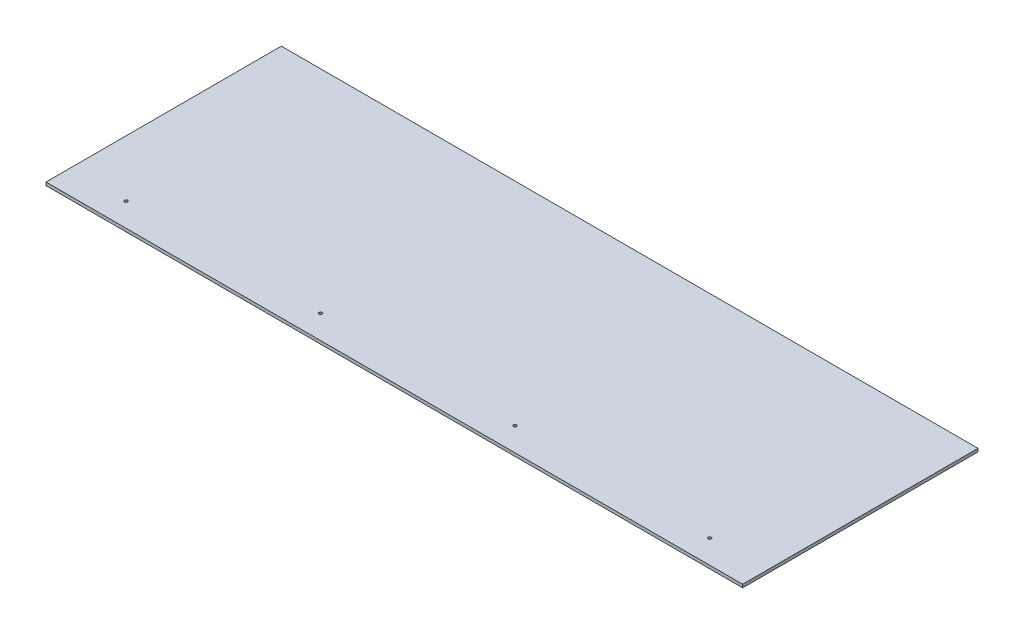
ISO-10303-21;
HEADER;
FILE_DESCRIPTION(('STEP AP214'),'2;1');
FILE_NAME('part.step','',(''),(''),'','','');
FILE_SCHEMA(('AUTOMOTIVE_DESIGN { 1 0 10303 214 1 1 1 1 }'));
ENDSEC;
DATA;
#1=APPLICATION_CONTEXT('core data for automotive mechanical design processes');
#2=APPLICATION_PROTOCOL_DEFINITION('international standard','automotive_design',2000,#1);
#3=PRODUCT_CONTEXT('',#1,'mechanical');
#4=PRODUCT('Part','Part','',(#3));
#5=PRODUCT_RELATED_PRODUCT_CATEGORY('part','',(#4));
#6=PRODUCT_DEFINITION_FORMATION('','',#4);
#7=PRODUCT_DEFINITION_CONTEXT('part definition',#1,'design');
#8=PRODUCT_DEFINITION('design','',#6,#7);
#9=PRODUCT_DEFINITION_SHAPE('','',#8);
#10=(LENGTH_UNIT() NAMED_UNIT(*) SI_UNIT(.MILLI.,.METRE.));
#11=(NAMED_UNIT(*) PLANE_ANGLE_UNIT() SI_UNIT($,.RADIAN.));
#12=(NAMED_UNIT(*) SI_UNIT($,.STERADIAN.) SOLID_ANGLE_UNIT());
#13=UNCERTAINTY_MEASURE_WITH_UNIT(LENGTH_MEASURE(1.E-05),#10,'distance_accuracy_value','');
#14=(GEOMETRIC_REPRESENTATION_CONTEXT(3) GLOBAL_UNCERTAINTY_ASSIGNED_CONTEXT((#13)) GLOBAL_UNIT_ASSIGNED_CONTEXT((#10,
#11,#12)) REPRESENTATION_CONTEXT('',''));
#15=CARTESIAN_POINT('',(0.,0.,0.));
#16=DIRECTION('',(0.,0.,1.));
#17=DIRECTION('',(1.,0.,0.));
#18=AXIS2_PLACEMENT_3D('',#15,#16,#17);
#19=CARTESIAN_POINT('',(2387.6,-6.35,238.125));
#20=DIRECTION('',(0.,-1.,0.));
#21=DIRECTION('',(0.,0.,-1.));
#22=AXIS2_PLACEMENT_3D('',#19,#20,#21);
#23=PLANE('',#22);
#24=DIRECTION('',(0.,0.,1.));
#25=VECTOR('',#24,1.);
#26=CARTESIAN_POINT('',(3092.45,-6.35,238.125));
#27=LINE('',#26,#25);
#28=CARTESIAN_POINT('',(3092.45,-6.35,0.));
#29=VERTEX_POINT('',#28);
#30=CARTESIAN_POINT('',(3092.45,-6.35,476.25));
#31=VERTEX_POINT('',#30);
#32=EDGE_CURVE('E58',#29,#31,#27,.T.);
#33=ORIENTED_EDGE('',*,*,#32,.T.);
#34=DIRECTION('',(1.,0.,0.));
#35=VECTOR('',#34,1.);
#36=CARTESIAN_POINT('',(2387.6,-6.35,476.25));
#37=LINE('',#36,#35);
#38=CARTESIAN_POINT('',(1682.75,-6.35,476.25));
#39=VERTEX_POINT('',#38);
#40=EDGE_CURVE('E50',#39,#31,#37,.T.);
#41=ORIENTED_EDGE('',*,*,#40,.F.);
#42=DIRECTION('',(0.,0.,1.));
#43=VECTOR('',#42,1.);
#44=CARTESIAN_POINT('',(1682.75,-6.35,238.125));
#45=LINE('',#44,#43);
#46=CARTESIAN_POINT('',(1682.75,-6.35,0.));
#47=VERTEX_POINT('',#46);
#48=EDGE_CURVE('E60',#47,#39,#45,.T.);
#49=ORIENTED_EDGE('',*,*,#48,.F.);
#50=DIRECTION('',(1.,0.,0.));
#51=VECTOR('',#50,1.);
#52=CARTESIAN_POINT('',(2387.6,-6.35,0.));
#53=LINE('',#52,#51);
#54=EDGE_CURVE('E55',#47,#29,#53,.T.);
#55=ORIENTED_EDGE('',*,*,#54,.T.);
#56=EDGE_LOOP('',(#33,#41,#49,#55));
#57=FACE_BOUND('',#56,.T.);
#58=CARTESIAN_POINT('',(1797.05,-6.3500000000003,428.625));
#59=DIRECTION('',(0.,-1.,0.));
#60=DIRECTION('',(0.,0.,-1.));
#61=AXIS2_PLACEMENT_3D('',#58,#59,#60);
#62=CIRCLE('',#61,3.175);
#63=CARTESIAN_POINT('',(1797.05,-6.3500000000003,425.45));
#64=VERTEX_POINT('',#63);
#65=EDGE_CURVE('E66',#64,#64,#62,.F.);
#66=ORIENTED_EDGE('',*,*,#65,.T.);
#67=EDGE_LOOP('',(#66));
#68=FACE_BOUND('',#67,.T.);
#69=CARTESIAN_POINT('',(2190.75,-6.3500000000003,428.625));
#70=DIRECTION('',(0.,-1.,0.));
#71=DIRECTION('',(0.,0.,-1.));
#72=AXIS2_PLACEMENT_3D('',#69,#70,#71);
#73=CIRCLE('',#72,3.175);
#74=CARTESIAN_POINT('',(2190.75,-6.3500000000003,425.45));
#75=VERTEX_POINT('',#74);
#76=EDGE_CURVE('E94',#75,#75,#73,.F.);
#77=ORIENTED_EDGE('',*,*,#76,.T.);
#78=EDGE_LOOP('',(#77));
#79=FACE_BOUND('',#78,.T.);
#80=CARTESIAN_POINT('',(2584.45,-6.3500000000003,428.625));
#81=DIRECTION('',(0.,-1.,0.));
#82=DIRECTION('',(0.,0.,-1.));
#83=AXIS2_PLACEMENT_3D('',#80,#81,#82);
#84=CIRCLE('',#83,3.175);
#85=CARTESIAN_POINT('',(2584.45,-6.3500000000003,425.45));
#86=VERTEX_POINT('',#85);
#87=EDGE_CURVE('E96',#86,#86,#84,.F.);
#88=ORIENTED_EDGE('',*,*,#87,.T.);
#89=EDGE_LOOP('',(#88));
#90=FACE_BOUND('',#89,.T.);
#91=CARTESIAN_POINT('',(2978.15,-6.3500000000003,428.625));
#92=DIRECTION('',(0.,-1.,0.));
#93=DIRECTION('',(0.,0.,-1.));
#94=AXIS2_PLACEMENT_3D('',#91,#92,#93);
#95=CIRCLE('',#94,3.175);
#96=CARTESIAN_POINT('',(2978.15,-6.3500000000003,425.45));
#97=VERTEX_POINT('',#96);
#98=EDGE_CURVE('E17',#97,#97,#95,.F.);
#99=ORIENTED_EDGE('',*,*,#98,.T.);
#100=EDGE_LOOP('',(#99));
#101=FACE_BOUND('',#100,.T.);
#102=ADVANCED_FACE('F14',(#57,#68,#79,#90,#101),#23,.T.);
#103=CARTESIAN_POINT('',(2978.15,-7227.09274295138,428.625));
#104=DIRECTION('',(0.,-1.,0.));
#105=DIRECTION('',(0.,0.,-1.));
#106=AXIS2_PLACEMENT_3D('',#103,#104,#105);
#107=CYLINDRICAL_SURFACE('',#106,3.175);
#108=CARTESIAN_POINT('',(2978.15,0.,428.625));
#109=DIRECTION('',(0.,-1.,0.));
#110=DIRECTION('',(0.,0.,-1.));
#111=AXIS2_PLACEMENT_3D('',#108,#109,#110);
#112=CIRCLE('',#111,3.175);
#113=CARTESIAN_POINT('',(2978.15,0.,425.45));
#114=VERTEX_POINT('',#113);
#115=EDGE_CURVE('E89',#114,#114,#112,.F.);
#116=ORIENTED_EDGE('',*,*,#115,.T.);
#117=EDGE_LOOP('',(#116));
#118=FACE_BOUND('',#117,.T.);
#119=ORIENTED_EDGE('',*,*,#98,.F.);
#120=EDGE_LOOP('',(#119));
#121=FACE_BOUND('',#120,.T.);
#122=ADVANCED_FACE('F104',(#118,#121),#107,.F.);
#123=CARTESIAN_POINT('',(2584.45,-7227.09274295138,428.625));
#124=DIRECTION('',(0.,-1.,0.));
#125=DIRECTION('',(0.,0.,-1.));
#126=AXIS2_PLACEMENT_3D('',#123,#124,#125);
#127=CYLINDRICAL_SURFACE('',#126,3.175);
#128=CARTESIAN_POINT('',(2584.45,0.,428.625));
#129=DIRECTION('',(0.,-1.,0.));
#130=DIRECTION('',(0.,0.,-1.));
#131=AXIS2_PLACEMENT_3D('',#128,#129,#130);
#132=CIRCLE('',#131,3.175);
#133=CARTESIAN_POINT('',(2584.45,0.,425.45));
#134=VERTEX_POINT('',#133);
#135=EDGE_CURVE('E86',#134,#134,#132,.F.);
#136=ORIENTED_EDGE('',*,*,#135,.T.);
#137=EDGE_LOOP('',(#136));
#138=FACE_BOUND('',#137,.T.);
#139=ORIENTED_EDGE('',*,*,#87,.F.);
#140=EDGE_LOOP('',(#139));
#141=FACE_BOUND('',#140,.T.);
#142=ADVANCED_FACE('F106',(#138,#141),#127,.F.);
#143=CARTESIAN_POINT('',(2190.75,-7227.09274295138,428.625));
#144=DIRECTION('',(0.,-1.,0.));
#145=DIRECTION('',(0.,0.,-1.));
#146=AXIS2_PLACEMENT_3D('',#143,#144,#145);
#147=CYLINDRICAL_SURFACE('',#146,3.175);
#148=CARTESIAN_POINT('',(2190.75,0.,428.625));
#149=DIRECTION('',(0.,-1.,0.));
#150=DIRECTION('',(0.,0.,-1.));
#151=AXIS2_PLACEMENT_3D('',#148,#149,#150);
#152=CIRCLE('',#151,3.175);
#153=CARTESIAN_POINT('',(2190.75,0.,425.45));
#154=VERTEX_POINT('',#153);
#155=EDGE_CURVE('E83',#154,#154,#152,.F.);
#156=ORIENTED_EDGE('',*,*,#155,.T.);
#157=EDGE_LOOP('',(#156));
#158=FACE_BOUND('',#157,.T.);
#159=ORIENTED_EDGE('',*,*,#76,.F.);
#160=EDGE_LOOP('',(#159));
#161=FACE_BOUND('',#160,.T.);
#162=ADVANCED_FACE('F113',(#158,#161),#147,.F.);
#163=CARTESIAN_POINT('',(1797.05,-7227.09274295138,428.625));
#164=DIRECTION('',(0.,-1.,0.));
#165=DIRECTION('',(0.,0.,-1.));
#166=AXIS2_PLACEMENT_3D('',#163,#164,#165);
#167=CYLINDRICAL_SURFACE('',#166,3.175);
#168=CARTESIAN_POINT('',(1797.05,0.,428.625));
#169=DIRECTION('',(0.,-1.,0.));
#170=DIRECTION('',(0.,0.,-1.));
#171=AXIS2_PLACEMENT_3D('',#168,#169,#170);
#172=CIRCLE('',#171,3.175);
#173=CARTESIAN_POINT('',(1797.05,0.,425.45));
#174=VERTEX_POINT('',#173);
#175=EDGE_CURVE('E80',#174,#174,#172,.F.);
#176=ORIENTED_EDGE('',*,*,#175,.T.);
#177=EDGE_LOOP('',(#176));
#178=FACE_BOUND('',#177,.T.);
#179=ORIENTED_EDGE('',*,*,#65,.F.);
#180=EDGE_LOOP('',(#179));
#181=FACE_BOUND('',#180,.T.);
#182=ADVANCED_FACE('F135',(#178,#181),#167,.F.);
#183=CARTESIAN_POINT('',(2387.6,-6.35,0.));
#184=DIRECTION('',(0.,0.,1.));
#185=DIRECTION('',(1.,0.,0.));
#186=AXIS2_PLACEMENT_3D('',#183,#184,#185);
#187=PLANE('',#186);
#188=DIRECTION('',(0.,1.,0.));
#189=VECTOR('',#188,1.);
#190=CARTESIAN_POINT('',(3092.45,-6.35,1.11022302462516E-13));
#191=LINE('',#190,#189);
#192=CARTESIAN_POINT('',(3092.45,0.,0.));
#193=VERTEX_POINT('',#192);
#194=EDGE_CURVE('E65',#193,#29,#191,.F.);
#195=ORIENTED_EDGE('',*,*,#194,.T.);
#196=ORIENTED_EDGE('',*,*,#54,.F.);
#197=DIRECTION('',(0.,1.,0.));
#198=VECTOR('',#197,1.);
#199=CARTESIAN_POINT('',(1682.75,-6.35,0.));
#200=LINE('',#199,#198);
#201=CARTESIAN_POINT('',(1682.75,0.,0.));
#202=VERTEX_POINT('',#201);
#203=EDGE_CURVE('E225',#202,#47,#200,.F.);
#204=ORIENTED_EDGE('',*,*,#203,.F.);
#205=DIRECTION('',(1.,0.,0.));
#206=VECTOR('',#205,1.);
#207=CARTESIAN_POINT('',(2387.6,0.,0.));
#208=LINE('',#207,#206);
#209=EDGE_CURVE('E76',#202,#193,#208,.T.);
#210=ORIENTED_EDGE('',*,*,#209,.T.);
#211=EDGE_LOOP('',(#195,#196,#204,#210));
#212=FACE_BOUND('',#211,.T.);
#213=ADVANCED_FACE('F75',(#212),#187,.F.);
#214=CARTESIAN_POINT('',(3092.45,-6.35,238.125));
#215=DIRECTION('',(-1.,0.,0.));
#216=DIRECTION('',(0.,0.,1.));
#217=AXIS2_PLACEMENT_3D('',#214,#215,#216);
#218=PLANE('',#217);
#219=DIRECTION('',(0.,1.,0.));
#220=VECTOR('',#219,1.);
#221=CARTESIAN_POINT('',(3092.45,-6.35,476.25));
#222=LINE('',#221,#220);
#223=CARTESIAN_POINT('',(3092.45,0.,476.25));
#224=VERTEX_POINT('',#223);
#225=EDGE_CURVE('E72',#31,#224,#222,.T.);
#226=ORIENTED_EDGE('',*,*,#225,.F.);
#227=ORIENTED_EDGE('',*,*,#32,.F.);
#228=ORIENTED_EDGE('',*,*,#194,.F.);
#229=DIRECTION('',(0.,0.,-1.));
#230=VECTOR('',#229,1.);
#231=CARTESIAN_POINT('',(3092.45,0.,238.125));
#232=LINE('',#231,#230);
#233=EDGE_CURVE('E218',#193,#224,#232,.F.);
#234=ORIENTED_EDGE('',*,*,#233,.T.);
#235=EDGE_LOOP('',(#226,#227,#228,#234));
#236=FACE_BOUND('',#235,.T.);
#237=ADVANCED_FACE('F69',(#236),#218,.F.);
#238=CARTESIAN_POINT('',(2387.6,-6.35,476.25));
#239=DIRECTION('',(0.,0.,1.));
#240=DIRECTION('',(1.,0.,0.));
#241=AXIS2_PLACEMENT_3D('',#238,#239,#240);
#242=PLANE('',#241);
#243=ORIENTED_EDGE('',*,*,#40,.T.);
#244=ORIENTED_EDGE('',*,*,#225,.T.);
#245=DIRECTION('',(1.,0.,0.));
#246=VECTOR('',#245,1.);
#247=CARTESIAN_POINT('',(2387.6,0.,476.25));
#248=LINE('',#247,#246);
#249=CARTESIAN_POINT('',(1682.75,0.,476.25));
#250=VERTEX_POINT('',#249);
#251=EDGE_CURVE('E23',#224,#250,#248,.F.);
#252=ORIENTED_EDGE('',*,*,#251,.T.);
#253=DIRECTION('',(0.,1.,0.));
#254=VECTOR('',#253,1.);
#255=CARTESIAN_POINT('',(1682.75,-6.35,476.25));
#256=LINE('',#255,#254);
#257=EDGE_CURVE('E31',#39,#250,#256,.T.);
#258=ORIENTED_EDGE('',*,*,#257,.F.);
#259=EDGE_LOOP('',(#243,#244,#252,#258));
#260=FACE_BOUND('',#259,.T.);
#261=ADVANCED_FACE('F124',(#260),#242,.T.);
#262=CARTESIAN_POINT('',(1682.75,-6.35,238.125));
#263=DIRECTION('',(-1.,0.,0.));
#264=DIRECTION('',(0.,0.,1.));
#265=AXIS2_PLACEMENT_3D('',#262,#263,#264);
#266=PLANE('',#265);
#267=ORIENTED_EDGE('',*,*,#48,.T.);
#268=ORIENTED_EDGE('',*,*,#257,.T.);
#269=DIRECTION('',(0.,0.,-1.));
#270=VECTOR('',#269,1.);
#271=CARTESIAN_POINT('',(1682.75,0.,238.125));
#272=LINE('',#271,#270);
#273=EDGE_CURVE('E9',#250,#202,#272,.T.);
#274=ORIENTED_EDGE('',*,*,#273,.T.);
#275=ORIENTED_EDGE('',*,*,#203,.T.);
#276=EDGE_LOOP('',(#267,#268,#274,#275));
#277=FACE_BOUND('',#276,.T.);
#278=ADVANCED_FACE('F118',(#277),#266,.T.);
#279=CARTESIAN_POINT('',(2387.6,0.,238.125));
#280=DIRECTION('',(0.,-1.,0.));
#281=DIRECTION('',(0.,0.,-1.));
#282=AXIS2_PLACEMENT_3D('',#279,#280,#281);
#283=PLANE('',#282);
#284=ORIENTED_EDGE('',*,*,#251,.F.);
#285=ORIENTED_EDGE('',*,*,#233,.F.);
#286=ORIENTED_EDGE('',*,*,#209,.F.);
#287=ORIENTED_EDGE('',*,*,#273,.F.);
#288=EDGE_LOOP('',(#284,#285,#286,#287));
#289=FACE_BOUND('',#288,.T.);
#290=ORIENTED_EDGE('',*,*,#175,.F.);
#291=EDGE_LOOP('',(#290));
#292=FACE_BOUND('',#291,.T.);
#293=ORIENTED_EDGE('',*,*,#155,.F.);
#294=EDGE_LOOP('',(#293));
#295=FACE_BOUND('',#294,.T.);
#296=ORIENTED_EDGE('',*,*,#135,.F.);
#297=EDGE_LOOP('',(#296));
#298=FACE_BOUND('',#297,.T.);
#299=ORIENTED_EDGE('',*,*,#115,.F.);
#300=EDGE_LOOP('',(#299));
#301=FACE_BOUND('',#300,.T.);
#302=ADVANCED_FACE('F116',(#289,#292,#295,#298,#301),#283,.F.);
#303=CLOSED_SHELL('',(#102,#122,#142,#162,#182,#213,#237,#261,#278,#302));
#304=MANIFOLD_SOLID_BREP('B1',#303);
#305=ADVANCED_BREP_SHAPE_REPRESENTATION('',(#18,#304),#14);
#306=SHAPE_DEFINITION_REPRESENTATION(#9,#305);
ENDSEC;
END-ISO-10303-21;
